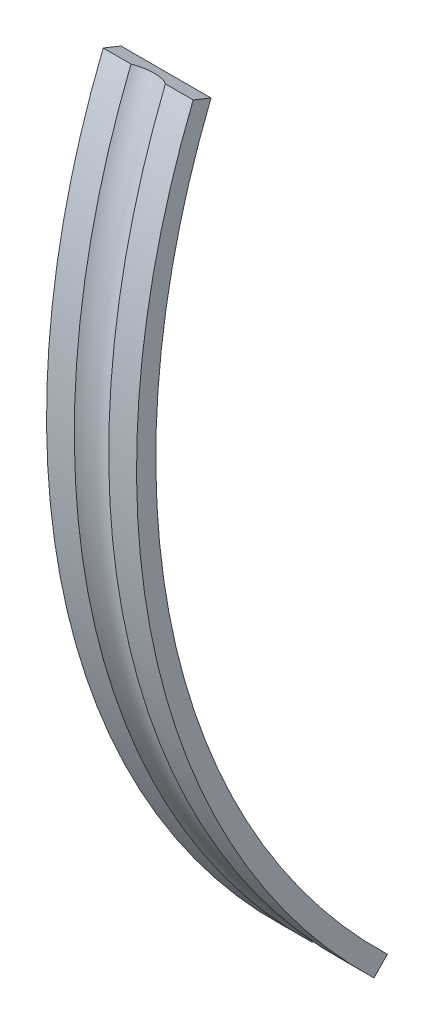
ISO-10303-21;
HEADER;
FILE_DESCRIPTION(('STEP AP214'),'2;1');
FILE_NAME('part.step','',(''),(''),'','','');
FILE_SCHEMA(('AUTOMOTIVE_DESIGN { 1 0 10303 214 1 1 1 1 }'));
ENDSEC;
DATA;
#1=APPLICATION_CONTEXT('core data for automotive mechanical design processes');
#2=APPLICATION_PROTOCOL_DEFINITION('international standard','automotive_design',2000,#1);
#3=PRODUCT_CONTEXT('',#1,'mechanical');
#4=PRODUCT('Part','Part','',(#3));
#5=PRODUCT_RELATED_PRODUCT_CATEGORY('part','',(#4));
#6=PRODUCT_DEFINITION_FORMATION('','',#4);
#7=PRODUCT_DEFINITION_CONTEXT('part definition',#1,'design');
#8=PRODUCT_DEFINITION('design','',#6,#7);
#9=PRODUCT_DEFINITION_SHAPE('','',#8);
#10=(LENGTH_UNIT() NAMED_UNIT(*) SI_UNIT(.MILLI.,.METRE.));
#11=(NAMED_UNIT(*) PLANE_ANGLE_UNIT() SI_UNIT($,.RADIAN.));
#12=(NAMED_UNIT(*) SI_UNIT($,.STERADIAN.) SOLID_ANGLE_UNIT());
#13=UNCERTAINTY_MEASURE_WITH_UNIT(LENGTH_MEASURE(1.E-05),#10,'distance_accuracy_value','');
#14=(GEOMETRIC_REPRESENTATION_CONTEXT(3) GLOBAL_UNCERTAINTY_ASSIGNED_CONTEXT((#13)) GLOBAL_UNIT_ASSIGNED_CONTEXT((#10,
#11,#12)) REPRESENTATION_CONTEXT('',''));
#15=CARTESIAN_POINT('',(0.,0.,0.));
#16=DIRECTION('',(0.,0.,1.));
#17=DIRECTION('',(1.,0.,0.));
#18=AXIS2_PLACEMENT_3D('',#15,#16,#17);
#19=CARTESIAN_POINT('',(-10.4382032302755,-42.4410482199806,40.9848438570807));
#20=DIRECTION('',(0.,-0.694658370459007,-0.719339800338642));
#21=DIRECTION('',(0.,0.719339800338642,-0.694658370459007));
#22=AXIS2_PLACEMENT_3D('',#19,#20,#21);
#23=PLANE('',#22);
#24=DIRECTION('',(0.,0.719339800338642,-0.694658370459007));
#25=VECTOR('',#24,1.);
#26=CARTESIAN_POINT('',(-3.42820323027553,-6.74564990502644E-13,-6.98650483141471E-13));
#27=LINE('',#26,#25);
#28=CARTESIAN_POINT('',(-3.42820323027553,-43.5200579204885,42.0268314127692));
#29=VERTEX_POINT('',#28);
#30=CARTESIAN_POINT('',(-3.42820323027553,-42.4410482199806,40.9848438570807));
#31=VERTEX_POINT('',#30);
#32=EDGE_CURVE('E129',#29,#31,#27,.T.);
#33=ORIENTED_EDGE('',*,*,#32,.F.);
#34=DIRECTION('',(1.,0.,0.));
#35=VECTOR('',#34,1.);
#36=CARTESIAN_POINT('',(-10.4382032302755,-43.5200579204885,42.0268314127692));
#37=LINE('',#36,#35);
#38=CARTESIAN_POINT('',(-5.59025704301686,-43.5200579204885,42.0268314127692));
#39=VERTEX_POINT('',#38);
#40=EDGE_CURVE('E138',#39,#29,#37,.T.);
#41=ORIENTED_EDGE('',*,*,#40,.F.);
#42=CARTESIAN_POINT('',(-6.92820323027553,-44.5990676209958,43.0688189684584));
#43=DIRECTION('',(0.,-0.694658370459007,-0.719339800338642));
#44=DIRECTION('',(0.,0.719339800338642,-0.694658370459007));
#45=AXIS2_PLACEMENT_3D('',#42,#43,#44);
#46=CIRCLE('',#45,2.01);
#47=CARTESIAN_POINT('',(-8.26614941753421,-43.5200579204885,42.0268314127692));
#48=VERTEX_POINT('',#47);
#49=EDGE_CURVE('E127',#39,#48,#46,.F.);
#50=ORIENTED_EDGE('',*,*,#49,.T.);
#51=CARTESIAN_POINT('',(-10.4282032302755,-43.5200579204885,42.0268314127692));
#52=VERTEX_POINT('',#51);
#53=EDGE_CURVE('E100',#52,#48,#37,.T.);
#54=ORIENTED_EDGE('',*,*,#53,.F.);
#55=DIRECTION('',(0.,-0.719339800338642,0.694658370459007));
#56=VECTOR('',#55,1.);
#57=CARTESIAN_POINT('',(-10.4282032302755,-6.74822502490658E-13,-6.9879915775707E-13));
#58=LINE('',#57,#56);
#59=CARTESIAN_POINT('',(-10.4282032302755,-42.4410482199806,40.9848438570807));
#60=VERTEX_POINT('',#59);
#61=EDGE_CURVE('E97',#60,#52,#58,.T.);
#62=ORIENTED_EDGE('',*,*,#61,.F.);
#63=DIRECTION('',(1.,0.,0.));
#64=VECTOR('',#63,1.);
#65=CARTESIAN_POINT('',(-10.4282032302755,-42.4410482199806,40.9848438570807));
#66=LINE('',#65,#64);
#67=EDGE_CURVE('E105',#60,#31,#66,.T.);
#68=ORIENTED_EDGE('',*,*,#67,.T.);
#69=EDGE_LOOP('',(#33,#41,#50,#54,#62,#68));
#70=FACE_BOUND('',#69,.T.);
#71=ADVANCED_FACE('F43',(#70),#23,.T.);
#72=CARTESIAN_POINT('',(-10.4382032302755,22.1017890115388,54.7038474194405));
#73=DIRECTION('',(0.,0.927183854566786,-0.374606593415914));
#74=DIRECTION('',(0.,0.374606593415914,0.927183854566787));
#75=AXIS2_PLACEMENT_3D('',#72,#73,#74);
#76=PLANE('',#75);
#77=DIRECTION('',(0.,0.374606593415914,0.927183854566787));
#78=VECTOR('',#77,1.);
#79=CARTESIAN_POINT('',(-3.42820323027553,-1.57366432720226E-13,0.));
#80=LINE('',#79,#78);
#81=CARTESIAN_POINT('',(-3.42820323027553,22.1017890115388,54.7038474194405));
#82=VERTEX_POINT('',#81);
#83=CARTESIAN_POINT('',(-3.42820323027553,22.6636989016627,56.0946232012907));
#84=VERTEX_POINT('',#83);
#85=EDGE_CURVE('E109',#82,#84,#80,.T.);
#86=ORIENTED_EDGE('',*,*,#85,.F.);
#87=DIRECTION('',(1.,0.,0.));
#88=VECTOR('',#87,1.);
#89=CARTESIAN_POINT('',(-10.4282032302755,22.1017890115388,54.7038474194405));
#90=LINE('',#89,#88);
#91=CARTESIAN_POINT('',(-10.4282032302755,22.1017890115388,54.7038474194405));
#92=VERTEX_POINT('',#91);
#93=EDGE_CURVE('E58',#92,#82,#90,.T.);
#94=ORIENTED_EDGE('',*,*,#93,.F.);
#95=DIRECTION('',(0.,-0.374606593415914,-0.927183854566787));
#96=VECTOR('',#95,1.);
#97=CARTESIAN_POINT('',(-10.4282032302755,-1.5762394470824E-13,0.));
#98=LINE('',#97,#96);
#99=CARTESIAN_POINT('',(-10.4282032302755,22.6636989016627,56.0946232012907));
#100=VERTEX_POINT('',#99);
#101=EDGE_CURVE('E98',#100,#92,#98,.T.);
#102=ORIENTED_EDGE('',*,*,#101,.F.);
#103=DIRECTION('',(1.,0.,0.));
#104=VECTOR('',#103,1.);
#105=CARTESIAN_POINT('',(-10.4382032302755,22.6636989016627,56.0946232012906));
#106=LINE('',#105,#104);
#107=CARTESIAN_POINT('',(-8.2661494175342,22.6636989016628,56.0946232012906));
#108=VERTEX_POINT('',#107);
#109=EDGE_CURVE('E47',#100,#108,#106,.T.);
#110=ORIENTED_EDGE('',*,*,#109,.T.);
#111=CARTESIAN_POINT('',(-6.92820323027553,23.2256087917867,57.4853989831408));
#112=DIRECTION('',(0.,0.927183854566786,-0.374606593415914));
#113=DIRECTION('',(0.,0.374606593415914,0.927183854566787));
#114=AXIS2_PLACEMENT_3D('',#111,#112,#113);
#115=CIRCLE('',#114,2.01);
#116=CARTESIAN_POINT('',(-5.59025704301686,22.6636989016628,56.0946232012906));
#117=VERTEX_POINT('',#116);
#118=EDGE_CURVE('E115',#108,#117,#115,.F.);
#119=ORIENTED_EDGE('',*,*,#118,.T.);
#120=EDGE_CURVE('E11',#117,#84,#106,.T.);
#121=ORIENTED_EDGE('',*,*,#120,.T.);
#122=EDGE_LOOP('',(#86,#94,#102,#110,#119,#121));
#123=FACE_BOUND('',#122,.T.);
#124=ADVANCED_FACE('F144',(#123),#76,.T.);
#125=CARTESIAN_POINT('',(-10.4382032302755,0.,0.));
#126=DIRECTION('',(1.,0.,0.));
#127=DIRECTION('',(0.,0.,-1.));
#128=AXIS2_PLACEMENT_3D('',#125,#126,#127);
#129=CYLINDRICAL_SURFACE('',#128,60.5);
#130=CARTESIAN_POINT('',(-10.4282032302755,0.,0.));
#131=DIRECTION('',(-1.,0.,0.));
#132=DIRECTION('',(0.,0.,1.));
#133=AXIS2_PLACEMENT_3D('',#130,#131,#132);
#134=CIRCLE('',#133,60.5);
#135=EDGE_CURVE('E108',#52,#100,#134,.T.);
#136=ORIENTED_EDGE('',*,*,#135,.F.);
#137=ORIENTED_EDGE('',*,*,#53,.T.);
#138=CARTESIAN_POINT('',(-8.26614941753421,0.,0.));
#139=DIRECTION('',(1.,0.,0.));
#140=DIRECTION('',(0.,0.,-1.));
#141=AXIS2_PLACEMENT_3D('',#138,#139,#140);
#142=CIRCLE('',#141,60.5);
#143=EDGE_CURVE('E124',#48,#108,#142,.F.);
#144=ORIENTED_EDGE('',*,*,#143,.T.);
#145=ORIENTED_EDGE('',*,*,#109,.F.);
#146=EDGE_LOOP('',(#136,#137,#144,#145));
#147=FACE_BOUND('',#146,.T.);
#148=ADVANCED_FACE('F148',(#147),#129,.T.);
#149=CARTESIAN_POINT('',(-3.42820323027553,0.,0.));
#150=DIRECTION('',(1.,0.,0.));
#151=DIRECTION('',(0.,0.,-1.));
#152=AXIS2_PLACEMENT_3D('',#149,#150,#151);
#153=CIRCLE('',#152,60.5);
#154=EDGE_CURVE('E131',#84,#29,#153,.T.);
#155=ORIENTED_EDGE('',*,*,#154,.F.);
#156=ORIENTED_EDGE('',*,*,#120,.F.);
#157=CARTESIAN_POINT('',(-5.59025704301686,0.,0.));
#158=DIRECTION('',(-1.,0.,0.));
#159=DIRECTION('',(0.,0.,1.));
#160=AXIS2_PLACEMENT_3D('',#157,#158,#159);
#161=CIRCLE('',#160,60.5);
#162=EDGE_CURVE('E118',#117,#39,#161,.F.);
#163=ORIENTED_EDGE('',*,*,#162,.T.);
#164=ORIENTED_EDGE('',*,*,#40,.T.);
#165=EDGE_LOOP('',(#155,#156,#163,#164));
#166=FACE_BOUND('',#165,.T.);
#167=ADVANCED_FACE('F150',(#166),#129,.T.);
#168=CARTESIAN_POINT('',(-10.4282032302755,0.,0.));
#169=DIRECTION('',(-1.,0.,0.));
#170=DIRECTION('',(0.,0.,1.));
#171=AXIS2_PLACEMENT_3D('',#168,#169,#170);
#172=PLANE('',#171);
#173=CARTESIAN_POINT('',(-10.4282032302755,0.,0.));
#174=DIRECTION('',(1.,0.,0.));
#175=DIRECTION('',(0.,0.,-1.));
#176=AXIS2_PLACEMENT_3D('',#173,#174,#175);
#177=CIRCLE('',#176,59.);
#178=EDGE_CURVE('E93',#92,#60,#177,.T.);
#179=ORIENTED_EDGE('',*,*,#178,.T.);
#180=ORIENTED_EDGE('',*,*,#61,.T.);
#181=ORIENTED_EDGE('',*,*,#135,.T.);
#182=ORIENTED_EDGE('',*,*,#101,.T.);
#183=EDGE_LOOP('',(#179,#180,#181,#182));
#184=FACE_BOUND('',#183,.T.);
#185=ADVANCED_FACE('F95',(#184),#172,.T.);
#186=CARTESIAN_POINT('',(-3.42820323027553,0.,0.));
#187=DIRECTION('',(1.,0.,0.));
#188=DIRECTION('',(0.,0.,-1.));
#189=AXIS2_PLACEMENT_3D('',#186,#187,#188);
#190=PLANE('',#189);
#191=ORIENTED_EDGE('',*,*,#154,.T.);
#192=ORIENTED_EDGE('',*,*,#32,.T.);
#193=CARTESIAN_POINT('',(-3.42820323027553,0.,0.));
#194=DIRECTION('',(1.,0.,0.));
#195=DIRECTION('',(0.,0.,-1.));
#196=AXIS2_PLACEMENT_3D('',#193,#194,#195);
#197=CIRCLE('',#196,59.);
#198=EDGE_CURVE('E113',#82,#31,#197,.T.);
#199=ORIENTED_EDGE('',*,*,#198,.F.);
#200=ORIENTED_EDGE('',*,*,#85,.T.);
#201=EDGE_LOOP('',(#191,#192,#199,#200));
#202=FACE_BOUND('',#201,.T.);
#203=ADVANCED_FACE('F159',(#202),#190,.T.);
#204=CARTESIAN_POINT('',(-10.4282032302755,0.,0.));
#205=DIRECTION('',(1.,0.,0.));
#206=DIRECTION('',(0.,0.,-1.));
#207=AXIS2_PLACEMENT_3D('',#204,#205,#206);
#208=CYLINDRICAL_SURFACE('',#207,59.);
#209=ORIENTED_EDGE('',*,*,#198,.T.);
#210=ORIENTED_EDGE('',*,*,#67,.F.);
#211=ORIENTED_EDGE('',*,*,#178,.F.);
#212=ORIENTED_EDGE('',*,*,#93,.T.);
#213=EDGE_LOOP('',(#209,#210,#211,#212));
#214=FACE_BOUND('',#213,.T.);
#215=ADVANCED_FACE('F111',(#214),#208,.F.);
#216=CARTESIAN_POINT('',(-6.92820323027553,0.,0.));
#217=DIRECTION('',(-1.,0.,0.));
#218=DIRECTION('',(0.,0.,1.));
#219=AXIS2_PLACEMENT_3D('',#216,#217,#218);
#220=TOROIDAL_SURFACE('',#219,62.,2.01);
#221=ORIENTED_EDGE('',*,*,#49,.F.);
#222=ORIENTED_EDGE('',*,*,#162,.F.);
#223=ORIENTED_EDGE('',*,*,#118,.F.);
#224=ORIENTED_EDGE('',*,*,#143,.F.);
#225=EDGE_LOOP('',(#221,#222,#223,#224));
#226=FACE_BOUND('',#225,.T.);
#227=ADVANCED_FACE('F45',(#226),#220,.F.);
#228=CLOSED_SHELL('',(#71,#124,#148,#167,#185,#203,#215,#227));
#229=MANIFOLD_SOLID_BREP('B2',#228);
#230=ADVANCED_BREP_SHAPE_REPRESENTATION('',(#18,#229),#14);
#231=SHAPE_DEFINITION_REPRESENTATION(#9,#230);
ENDSEC;
END-ISO-10303-21;
